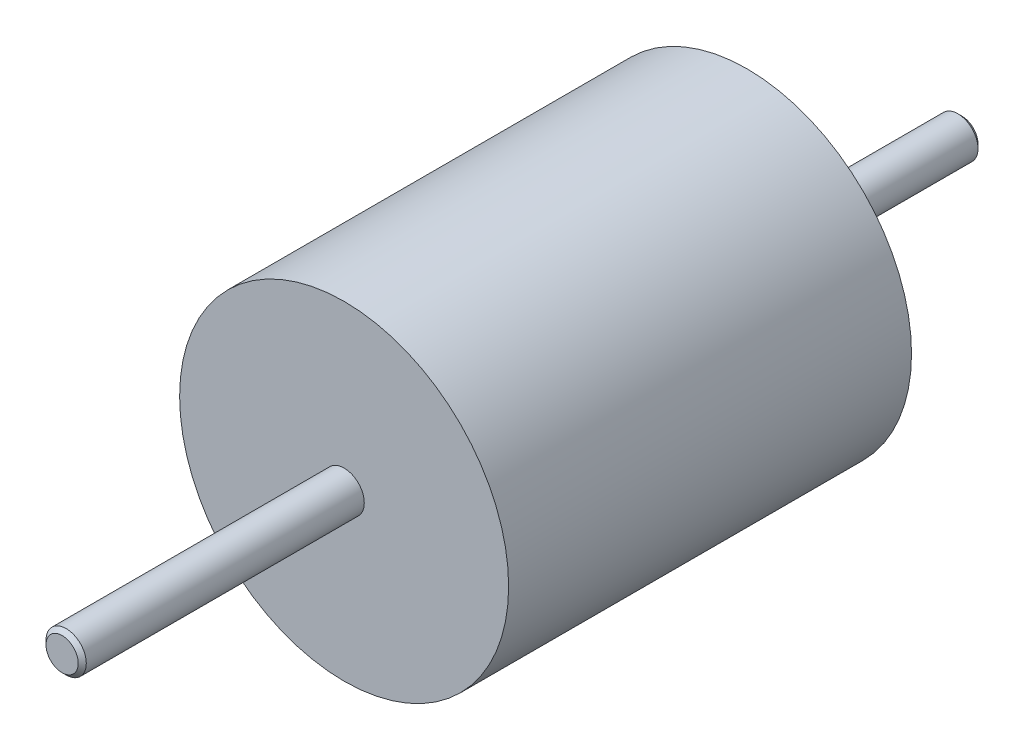
ISO-10303-21;
HEADER;
FILE_DESCRIPTION(('STEP AP214'),'2;1');
FILE_NAME('part.step','',(''),(''),'','','');
FILE_SCHEMA(('AUTOMOTIVE_DESIGN { 1 0 10303 214 1 1 1 1 }'));
ENDSEC;
DATA;
#1=APPLICATION_CONTEXT('core data for automotive mechanical design processes');
#2=APPLICATION_PROTOCOL_DEFINITION('international standard','automotive_design',2000,#1);
#3=PRODUCT_CONTEXT('',#1,'mechanical');
#4=PRODUCT('Part','Part','',(#3));
#5=PRODUCT_RELATED_PRODUCT_CATEGORY('part','',(#4));
#6=PRODUCT_DEFINITION_FORMATION('','',#4);
#7=PRODUCT_DEFINITION_CONTEXT('part definition',#1,'design');
#8=PRODUCT_DEFINITION('design','',#6,#7);
#9=PRODUCT_DEFINITION_SHAPE('','',#8);
#10=(LENGTH_UNIT() NAMED_UNIT(*) SI_UNIT(.MILLI.,.METRE.));
#11=(NAMED_UNIT(*) PLANE_ANGLE_UNIT() SI_UNIT($,.RADIAN.));
#12=(NAMED_UNIT(*) SI_UNIT($,.STERADIAN.) SOLID_ANGLE_UNIT());
#13=UNCERTAINTY_MEASURE_WITH_UNIT(LENGTH_MEASURE(1.E-05),#10,'distance_accuracy_value','');
#14=(GEOMETRIC_REPRESENTATION_CONTEXT(3) GLOBAL_UNCERTAINTY_ASSIGNED_CONTEXT((#13)) GLOBAL_UNIT_ASSIGNED_CONTEXT((#10,
#11,#12)) REPRESENTATION_CONTEXT('',''));
#15=CARTESIAN_POINT('',(0.,0.,0.));
#16=DIRECTION('',(0.,0.,1.));
#17=DIRECTION('',(1.,0.,0.));
#18=AXIS2_PLACEMENT_3D('',#15,#16,#17);
#19=CARTESIAN_POINT('',(0.,0.,33.5));
#20=DIRECTION('',(0.,0.,-1.));
#21=DIRECTION('',(-1.,0.,0.));
#22=AXIS2_PLACEMENT_3D('',#19,#20,#21);
#23=CYLINDRICAL_SURFACE('',#22,1.5);
#24=CARTESIAN_POINT('',(0.,0.,-33.2));
#25=DIRECTION('',(0.,0.,1.));
#26=DIRECTION('',(1.,0.,0.));
#27=AXIS2_PLACEMENT_3D('',#24,#25,#26);
#28=CIRCLE('',#27,1.5);
#29=CARTESIAN_POINT('',(1.5,0.,-33.2));
#30=VERTEX_POINT('',#29);
#31=EDGE_CURVE('E59',#30,#30,#28,.T.);
#32=ORIENTED_EDGE('',*,*,#31,.T.);
#33=EDGE_LOOP('',(#32));
#34=FACE_BOUND('',#33,.T.);
#35=CARTESIAN_POINT('',(0.,0.,-17.5));
#36=DIRECTION('',(0.,0.,1.));
#37=DIRECTION('',(1.,0.,0.));
#38=AXIS2_PLACEMENT_3D('',#35,#36,#37);
#39=CIRCLE('',#38,1.5);
#40=CARTESIAN_POINT('',(1.5,0.,-17.5));
#41=VERTEX_POINT('',#40);
#42=EDGE_CURVE('E64',#41,#41,#39,.T.);
#43=ORIENTED_EDGE('',*,*,#42,.F.);
#44=EDGE_LOOP('',(#43));
#45=FACE_BOUND('',#44,.T.);
#46=ADVANCED_FACE('F43',(#34,#45),#23,.T.);
#47=CARTESIAN_POINT('',(0.,0.,-33.5));
#48=DIRECTION('',(0.,0.,1.));
#49=DIRECTION('',(1.,0.,0.));
#50=AXIS2_PLACEMENT_3D('',#47,#48,#49);
#51=PLANE('',#50);
#52=CARTESIAN_POINT('',(0.,0.,-33.5));
#53=DIRECTION('',(0.,0.,1.));
#54=DIRECTION('',(1.,0.,0.));
#55=AXIS2_PLACEMENT_3D('',#52,#53,#54);
#56=CIRCLE('',#55,1.19999999999999);
#57=CARTESIAN_POINT('',(1.19999999999999,0.,-33.5));
#58=VERTEX_POINT('',#57);
#59=EDGE_CURVE('E55',#58,#58,#56,.F.);
#60=ORIENTED_EDGE('',*,*,#59,.T.);
#61=EDGE_LOOP('',(#60));
#62=FACE_BOUND('',#61,.T.);
#63=ADVANCED_FACE('F89',(#62),#51,.F.);
#64=CARTESIAN_POINT('',(0.,0.,-17.5));
#65=DIRECTION('',(0.,0.,1.));
#66=DIRECTION('',(1.,0.,0.));
#67=AXIS2_PLACEMENT_3D('',#64,#65,#66);
#68=CYLINDRICAL_SURFACE('',#67,12.25);
#69=CARTESIAN_POINT('',(0.,0.,-17.5));
#70=DIRECTION('',(0.,0.,1.));
#71=DIRECTION('',(1.,0.,0.));
#72=AXIS2_PLACEMENT_3D('',#69,#70,#71);
#73=CIRCLE('',#72,12.25);
#74=CARTESIAN_POINT('',(12.25,0.,-17.5));
#75=VERTEX_POINT('',#74);
#76=EDGE_CURVE('E67',#75,#75,#73,.T.);
#77=ORIENTED_EDGE('',*,*,#76,.T.);
#78=EDGE_LOOP('',(#77));
#79=FACE_BOUND('',#78,.T.);
#80=CARTESIAN_POINT('',(0.,0.,12.5));
#81=DIRECTION('',(0.,0.,1.));
#82=DIRECTION('',(1.,0.,0.));
#83=AXIS2_PLACEMENT_3D('',#80,#81,#82);
#84=CIRCLE('',#83,12.25);
#85=CARTESIAN_POINT('',(12.25,0.,12.5));
#86=VERTEX_POINT('',#85);
#87=EDGE_CURVE('E68',#86,#86,#84,.T.);
#88=ORIENTED_EDGE('',*,*,#87,.F.);
#89=EDGE_LOOP('',(#88));
#90=FACE_BOUND('',#89,.T.);
#91=ADVANCED_FACE('F87',(#79,#90),#68,.T.);
#92=CARTESIAN_POINT('',(0.,0.,-17.5));
#93=DIRECTION('',(0.,0.,1.));
#94=DIRECTION('',(1.,0.,0.));
#95=AXIS2_PLACEMENT_3D('',#92,#93,#94);
#96=PLANE('',#95);
#97=ORIENTED_EDGE('',*,*,#42,.T.);
#98=EDGE_LOOP('',(#97));
#99=FACE_BOUND('',#98,.T.);
#100=ORIENTED_EDGE('',*,*,#76,.F.);
#101=EDGE_LOOP('',(#100));
#102=FACE_BOUND('',#101,.T.);
#103=ADVANCED_FACE('F83',(#99,#102),#96,.F.);
#104=CARTESIAN_POINT('',(0.,0.,12.5));
#105=DIRECTION('',(0.,0.,1.));
#106=DIRECTION('',(1.,0.,0.));
#107=AXIS2_PLACEMENT_3D('',#104,#105,#106);
#108=PLANE('',#107);
#109=CARTESIAN_POINT('',(0.,0.,12.5));
#110=DIRECTION('',(0.,0.,1.));
#111=DIRECTION('',(1.,0.,0.));
#112=AXIS2_PLACEMENT_3D('',#109,#110,#111);
#113=CIRCLE('',#112,1.5);
#114=CARTESIAN_POINT('',(1.5,0.,12.5));
#115=VERTEX_POINT('',#114);
#116=EDGE_CURVE('E71',#115,#115,#113,.T.);
#117=ORIENTED_EDGE('',*,*,#116,.F.);
#118=EDGE_LOOP('',(#117));
#119=FACE_BOUND('',#118,.T.);
#120=ORIENTED_EDGE('',*,*,#87,.T.);
#121=EDGE_LOOP('',(#120));
#122=FACE_BOUND('',#121,.T.);
#123=ADVANCED_FACE('F79',(#119,#122),#108,.T.);
#124=CARTESIAN_POINT('',(0.,0.,33.5));
#125=DIRECTION('',(0.,0.,1.));
#126=DIRECTION('',(1.,0.,0.));
#127=AXIS2_PLACEMENT_3D('',#124,#125,#126);
#128=PLANE('',#127);
#129=CARTESIAN_POINT('',(0.,0.,33.5));
#130=DIRECTION('',(0.,0.,1.));
#131=DIRECTION('',(1.,0.,0.));
#132=AXIS2_PLACEMENT_3D('',#129,#130,#131);
#133=CIRCLE('',#132,1.2);
#134=CARTESIAN_POINT('',(1.2,0.,33.5));
#135=VERTEX_POINT('',#134);
#136=EDGE_CURVE('E51',#135,#135,#133,.T.);
#137=ORIENTED_EDGE('',*,*,#136,.T.);
#138=EDGE_LOOP('',(#137));
#139=FACE_BOUND('',#138,.T.);
#140=ADVANCED_FACE('F82',(#139),#128,.T.);
#141=CARTESIAN_POINT('',(0.,0.,33.2));
#142=DIRECTION('',(0.,0.,1.));
#143=DIRECTION('',(1.,0.,0.));
#144=AXIS2_PLACEMENT_3D('',#141,#142,#143);
#145=CIRCLE('',#144,1.5);
#146=CARTESIAN_POINT('',(1.5,0.,33.2));
#147=VERTEX_POINT('',#146);
#148=EDGE_CURVE('E10',#147,#147,#145,.F.);
#149=ORIENTED_EDGE('',*,*,#148,.T.);
#150=EDGE_LOOP('',(#149));
#151=FACE_BOUND('',#150,.T.);
#152=ORIENTED_EDGE('',*,*,#116,.T.);
#153=EDGE_LOOP('',(#152));
#154=FACE_BOUND('',#153,.T.);
#155=ADVANCED_FACE('F77',(#151,#154),#23,.T.);
#156=CARTESIAN_POINT('',(0.,0.,-33.2));
#157=DIRECTION('',(0.,0.,1.));
#158=DIRECTION('',(1.,0.,0.));
#159=AXIS2_PLACEMENT_3D('',#156,#157,#158);
#160=CONICAL_SURFACE('',#159,1.5,0.785398163397423);
#161=ORIENTED_EDGE('',*,*,#59,.F.);
#162=EDGE_LOOP('',(#161));
#163=FACE_BOUND('',#162,.T.);
#164=ORIENTED_EDGE('',*,*,#31,.F.);
#165=EDGE_LOOP('',(#164));
#166=FACE_BOUND('',#165,.T.);
#167=ADVANCED_FACE('F108',(#163,#166),#160,.T.);
#168=CARTESIAN_POINT('',(0.,0.,33.5));
#169=DIRECTION('',(0.,0.,-1.));
#170=DIRECTION('',(-1.,0.,0.));
#171=AXIS2_PLACEMENT_3D('',#168,#169,#170);
#172=CONICAL_SURFACE('',#171,1.2,0.785398163397435);
#173=ORIENTED_EDGE('',*,*,#148,.F.);
#174=EDGE_LOOP('',(#173));
#175=FACE_BOUND('',#174,.T.);
#176=ORIENTED_EDGE('',*,*,#136,.F.);
#177=EDGE_LOOP('',(#176));
#178=FACE_BOUND('',#177,.T.);
#179=ADVANCED_FACE('F46',(#175,#178),#172,.T.);
#180=CLOSED_SHELL('',(#46,#63,#91,#103,#123,#140,#155,#167,#179));
#181=MANIFOLD_SOLID_BREP('B2',#180);
#182=ADVANCED_BREP_SHAPE_REPRESENTATION('',(#18,#181),#14);
#183=SHAPE_DEFINITION_REPRESENTATION(#9,#182);
ENDSEC;
END-ISO-10303-21;
